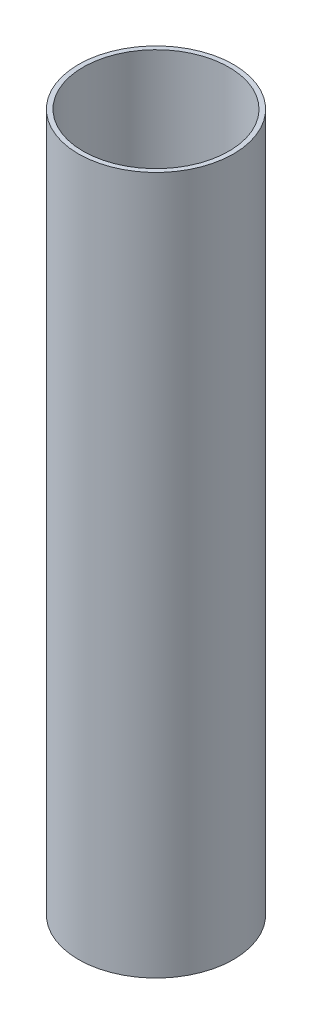
ISO-10303-21;
HEADER;
FILE_DESCRIPTION(('STEP AP214'),'2;1');
FILE_NAME('part.step','',(''),(''),'','','');
FILE_SCHEMA(('AUTOMOTIVE_DESIGN { 1 0 10303 214 1 1 1 1 }'));
ENDSEC;
DATA;
#1=APPLICATION_CONTEXT('core data for automotive mechanical design processes');
#2=APPLICATION_PROTOCOL_DEFINITION('international standard','automotive_design',2000,#1);
#3=PRODUCT_CONTEXT('',#1,'mechanical');
#4=PRODUCT('Part','Part','',(#3));
#5=PRODUCT_RELATED_PRODUCT_CATEGORY('part','',(#4));
#6=PRODUCT_DEFINITION_FORMATION('','',#4);
#7=PRODUCT_DEFINITION_CONTEXT('part definition',#1,'design');
#8=PRODUCT_DEFINITION('design','',#6,#7);
#9=PRODUCT_DEFINITION_SHAPE('','',#8);
#10=(LENGTH_UNIT() NAMED_UNIT(*) SI_UNIT(.MILLI.,.METRE.));
#11=(NAMED_UNIT(*) PLANE_ANGLE_UNIT() SI_UNIT($,.RADIAN.));
#12=(NAMED_UNIT(*) SI_UNIT($,.STERADIAN.) SOLID_ANGLE_UNIT());
#13=UNCERTAINTY_MEASURE_WITH_UNIT(LENGTH_MEASURE(1.E-05),#10,'distance_accuracy_value','');
#14=(GEOMETRIC_REPRESENTATION_CONTEXT(3) GLOBAL_UNCERTAINTY_ASSIGNED_CONTEXT((#13)) GLOBAL_UNIT_ASSIGNED_CONTEXT((#10,
#11,#12)) REPRESENTATION_CONTEXT('',''));
#15=CARTESIAN_POINT('',(0.,0.,0.));
#16=DIRECTION('',(0.,0.,1.));
#17=DIRECTION('',(1.,0.,0.));
#18=AXIS2_PLACEMENT_3D('',#15,#16,#17);
#19=CARTESIAN_POINT('',(0.,57.15,0.));
#20=DIRECTION('',(0.,1.,0.));
#21=DIRECTION('',(0.,0.,1.));
#22=AXIS2_PLACEMENT_3D('',#19,#20,#21);
#23=PLANE('',#22);
#24=CARTESIAN_POINT('',(0.,57.15,0.));
#25=DIRECTION('',(0.,1.,0.));
#26=DIRECTION('',(0.,0.,1.));
#27=AXIS2_PLACEMENT_3D('',#24,#25,#26);
#28=CIRCLE('',#27,6.35);
#29=CARTESIAN_POINT('',(0.,57.15,6.35));
#30=VERTEX_POINT('',#29);
#31=EDGE_CURVE('E10',#30,#30,#28,.T.);
#32=ORIENTED_EDGE('',*,*,#31,.T.);
#33=EDGE_LOOP('',(#32));
#34=FACE_BOUND('',#33,.T.);
#35=CARTESIAN_POINT('',(0.,57.15,0.));
#36=DIRECTION('',(0.,1.,0.));
#37=DIRECTION('',(0.,0.,1.));
#38=AXIS2_PLACEMENT_3D('',#35,#36,#37);
#39=CIRCLE('',#38,5.969);
#40=CARTESIAN_POINT('',(0.,57.15,5.969));
#41=VERTEX_POINT('',#40);
#42=EDGE_CURVE('E43',#41,#41,#39,.T.);
#43=ORIENTED_EDGE('',*,*,#42,.F.);
#44=EDGE_LOOP('',(#43));
#45=FACE_BOUND('',#44,.T.);
#46=ADVANCED_FACE('F32',(#34,#45),#23,.T.);
#47=CARTESIAN_POINT('',(0.,0.,0.));
#48=DIRECTION('',(0.,1.,0.));
#49=DIRECTION('',(0.,0.,1.));
#50=AXIS2_PLACEMENT_3D('',#47,#48,#49);
#51=PLANE('',#50);
#52=CARTESIAN_POINT('',(0.,0.,0.));
#53=DIRECTION('',(0.,1.,0.));
#54=DIRECTION('',(0.,0.,1.));
#55=AXIS2_PLACEMENT_3D('',#52,#53,#54);
#56=CIRCLE('',#55,6.35);
#57=CARTESIAN_POINT('',(0.,0.,6.35));
#58=VERTEX_POINT('',#57);
#59=EDGE_CURVE('E36',#58,#58,#56,.T.);
#60=ORIENTED_EDGE('',*,*,#59,.F.);
#61=EDGE_LOOP('',(#60));
#62=FACE_BOUND('',#61,.T.);
#63=CARTESIAN_POINT('',(0.,0.,0.));
#64=DIRECTION('',(0.,1.,0.));
#65=DIRECTION('',(0.,0.,1.));
#66=AXIS2_PLACEMENT_3D('',#63,#64,#65);
#67=CIRCLE('',#66,5.969);
#68=CARTESIAN_POINT('',(0.,0.,5.969));
#69=VERTEX_POINT('',#68);
#70=EDGE_CURVE('E45',#69,#69,#67,.T.);
#71=ORIENTED_EDGE('',*,*,#70,.T.);
#72=EDGE_LOOP('',(#71));
#73=FACE_BOUND('',#72,.T.);
#74=ADVANCED_FACE('F55',(#62,#73),#51,.F.);
#75=CARTESIAN_POINT('',(0.,57.15,0.));
#76=DIRECTION('',(0.,-1.,0.));
#77=DIRECTION('',(0.,0.,-1.));
#78=AXIS2_PLACEMENT_3D('',#75,#76,#77);
#79=CYLINDRICAL_SURFACE('',#78,6.35);
#80=ORIENTED_EDGE('',*,*,#31,.F.);
#81=EDGE_LOOP('',(#80));
#82=FACE_BOUND('',#81,.T.);
#83=ORIENTED_EDGE('',*,*,#59,.T.);
#84=EDGE_LOOP('',(#83));
#85=FACE_BOUND('',#84,.T.);
#86=ADVANCED_FACE('F34',(#82,#85),#79,.T.);
#87=CARTESIAN_POINT('',(0.,57.15,0.));
#88=DIRECTION('',(0.,-1.,0.));
#89=DIRECTION('',(0.,0.,-1.));
#90=AXIS2_PLACEMENT_3D('',#87,#88,#89);
#91=CYLINDRICAL_SURFACE('',#90,5.969);
#92=ORIENTED_EDGE('',*,*,#42,.T.);
#93=EDGE_LOOP('',(#92));
#94=FACE_BOUND('',#93,.T.);
#95=ORIENTED_EDGE('',*,*,#70,.F.);
#96=EDGE_LOOP('',(#95));
#97=FACE_BOUND('',#96,.T.);
#98=ADVANCED_FACE('F51',(#94,#97),#91,.F.);
#99=CLOSED_SHELL('',(#46,#74,#86,#98));
#100=MANIFOLD_SOLID_BREP('B2',#99);
#101=ADVANCED_BREP_SHAPE_REPRESENTATION('',(#18,#100),#14);
#102=SHAPE_DEFINITION_REPRESENTATION(#9,#101);
ENDSEC;
END-ISO-10303-21;
